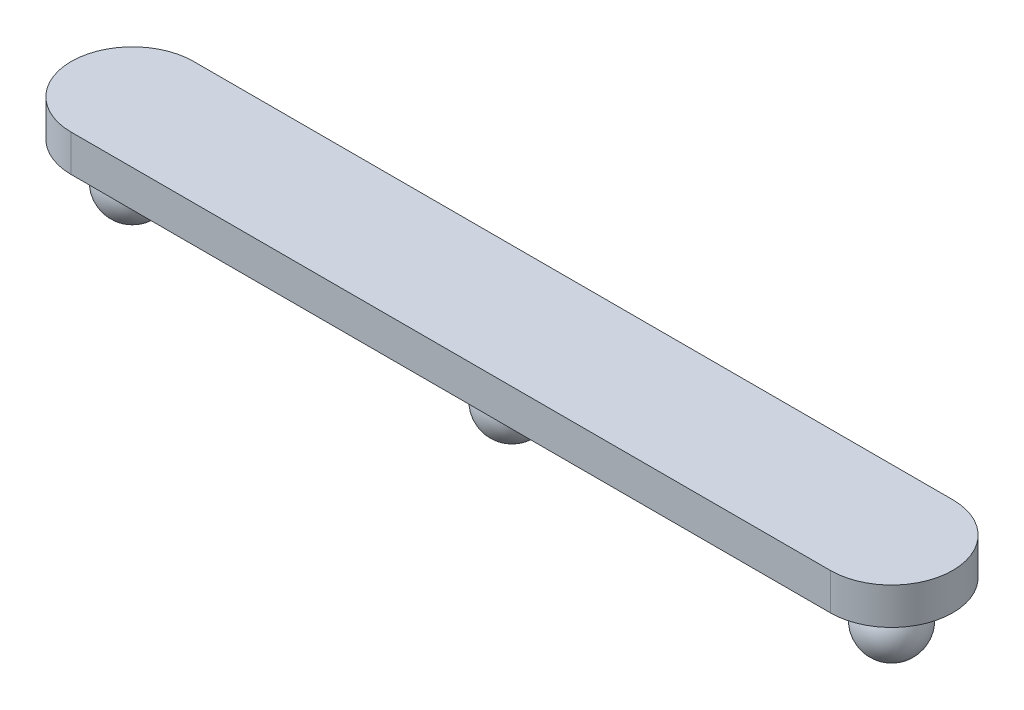
ISO-10303-21;
HEADER;
FILE_DESCRIPTION(('STEP AP214'),'2;1');
FILE_NAME('part.step','',(''),(''),'','','');
FILE_SCHEMA(('AUTOMOTIVE_DESIGN { 1 0 10303 214 1 1 1 1 }'));
ENDSEC;
DATA;
#1=APPLICATION_CONTEXT('core data for automotive mechanical design processes');
#2=APPLICATION_PROTOCOL_DEFINITION('international standard','automotive_design',2000,#1);
#3=PRODUCT_CONTEXT('',#1,'mechanical');
#4=PRODUCT('Part','Part','',(#3));
#5=PRODUCT_RELATED_PRODUCT_CATEGORY('part','',(#4));
#6=PRODUCT_DEFINITION_FORMATION('','',#4);
#7=PRODUCT_DEFINITION_CONTEXT('part definition',#1,'design');
#8=PRODUCT_DEFINITION('design','',#6,#7);
#9=PRODUCT_DEFINITION_SHAPE('','',#8);
#10=(LENGTH_UNIT() NAMED_UNIT(*) SI_UNIT(.MILLI.,.METRE.));
#11=(NAMED_UNIT(*) PLANE_ANGLE_UNIT() SI_UNIT($,.RADIAN.));
#12=(NAMED_UNIT(*) SI_UNIT($,.STERADIAN.) SOLID_ANGLE_UNIT());
#13=UNCERTAINTY_MEASURE_WITH_UNIT(LENGTH_MEASURE(1.E-05),#10,'distance_accuracy_value','');
#14=(GEOMETRIC_REPRESENTATION_CONTEXT(3) GLOBAL_UNCERTAINTY_ASSIGNED_CONTEXT((#13)) GLOBAL_UNIT_ASSIGNED_CONTEXT((#10,
#11,#12)) REPRESENTATION_CONTEXT('',''));
#15=CARTESIAN_POINT('',(0.,0.,0.));
#16=DIRECTION('',(0.,0.,1.));
#17=DIRECTION('',(1.,0.,0.));
#18=AXIS2_PLACEMENT_3D('',#15,#16,#17);
#19=CARTESIAN_POINT('',(31.,-27.,202.320508075689));
#20=DIRECTION('',(0.,1.,0.));
#21=DIRECTION('',(0.,0.,1.));
#22=AXIS2_PLACEMENT_3D('',#19,#20,#21);
#23=CYLINDRICAL_SURFACE('',#22,5.);
#24=CARTESIAN_POINT('',(31.,-24.,202.320508075689));
#25=DIRECTION('',(0.,-1.,0.));
#26=DIRECTION('',(0.,0.,-1.));
#27=AXIS2_PLACEMENT_3D('',#24,#25,#26);
#28=CIRCLE('',#27,5.);
#29=CARTESIAN_POINT('',(31.,-24.,197.320508075689));
#30=VERTEX_POINT('',#29);
#31=CARTESIAN_POINT('',(31.,-24.,207.320508075689));
#32=VERTEX_POINT('',#31);
#33=EDGE_CURVE('E107',#30,#32,#28,.T.);
#34=ORIENTED_EDGE('',*,*,#33,.T.);
#35=DIRECTION('',(0.,1.,0.));
#36=VECTOR('',#35,1.);
#37=CARTESIAN_POINT('',(31.,-27.,207.320508075689));
#38=LINE('',#37,#36);
#39=CARTESIAN_POINT('',(31.,-27.,207.320508075689));
#40=VERTEX_POINT('',#39);
#41=EDGE_CURVE('E11',#40,#32,#38,.T.);
#42=ORIENTED_EDGE('',*,*,#41,.F.);
#43=CARTESIAN_POINT('',(31.,-27.,202.320508075689));
#44=DIRECTION('',(0.,-1.,0.));
#45=DIRECTION('',(0.,0.,-1.));
#46=AXIS2_PLACEMENT_3D('',#43,#44,#45);
#47=CIRCLE('',#46,5.);
#48=CARTESIAN_POINT('',(31.,-27.,197.320508075689));
#49=VERTEX_POINT('',#48);
#50=EDGE_CURVE('E94',#49,#40,#47,.T.);
#51=ORIENTED_EDGE('',*,*,#50,.F.);
#52=DIRECTION('',(0.,1.,0.));
#53=VECTOR('',#52,1.);
#54=CARTESIAN_POINT('',(31.,-27.,197.320508075689));
#55=LINE('',#54,#53);
#56=EDGE_CURVE('E103',#49,#30,#55,.T.);
#57=ORIENTED_EDGE('',*,*,#56,.T.);
#58=EDGE_LOOP('',(#34,#42,#51,#57));
#59=FACE_BOUND('',#58,.T.);
#60=ADVANCED_FACE('F41',(#59),#23,.T.);
#61=CARTESIAN_POINT('',(31.,-27.,207.320508075689));
#62=DIRECTION('',(0.,0.,-1.));
#63=DIRECTION('',(-1.,0.,0.));
#64=AXIS2_PLACEMENT_3D('',#61,#62,#63);
#65=PLANE('',#64);
#66=DIRECTION('',(-1.,0.,0.));
#67=VECTOR('',#66,1.);
#68=CARTESIAN_POINT('',(31.,-24.,207.320508075689));
#69=LINE('',#68,#67);
#70=CARTESIAN_POINT('',(-31.,-24.,207.320508075689));
#71=VERTEX_POINT('',#70);
#72=EDGE_CURVE('E98',#32,#71,#69,.T.);
#73=ORIENTED_EDGE('',*,*,#72,.T.);
#74=DIRECTION('',(0.,1.,0.));
#75=VECTOR('',#74,1.);
#76=CARTESIAN_POINT('',(-31.,-27.,207.320508075689));
#77=LINE('',#76,#75);
#78=CARTESIAN_POINT('',(-31.,-27.,207.320508075689));
#79=VERTEX_POINT('',#78);
#80=EDGE_CURVE('E50',#79,#71,#77,.T.);
#81=ORIENTED_EDGE('',*,*,#80,.F.);
#82=DIRECTION('',(-1.,0.,0.));
#83=VECTOR('',#82,1.);
#84=CARTESIAN_POINT('',(31.,-27.,207.320508075689));
#85=LINE('',#84,#83);
#86=EDGE_CURVE('E89',#40,#79,#85,.T.);
#87=ORIENTED_EDGE('',*,*,#86,.F.);
#88=ORIENTED_EDGE('',*,*,#41,.T.);
#89=EDGE_LOOP('',(#73,#81,#87,#88));
#90=FACE_BOUND('',#89,.T.);
#91=ADVANCED_FACE('F97',(#90),#65,.F.);
#92=CARTESIAN_POINT('',(-31.,-27.,202.320508075689));
#93=DIRECTION('',(0.,1.,0.));
#94=DIRECTION('',(0.,0.,1.));
#95=AXIS2_PLACEMENT_3D('',#92,#93,#94);
#96=CYLINDRICAL_SURFACE('',#95,5.);
#97=CARTESIAN_POINT('',(-31.,-24.,202.320508075689));
#98=DIRECTION('',(0.,-1.,0.));
#99=DIRECTION('',(0.,0.,-1.));
#100=AXIS2_PLACEMENT_3D('',#97,#98,#99);
#101=CIRCLE('',#100,5.);
#102=CARTESIAN_POINT('',(-31.,-24.,197.320508075689));
#103=VERTEX_POINT('',#102);
#104=EDGE_CURVE('E76',#71,#103,#101,.T.);
#105=ORIENTED_EDGE('',*,*,#104,.T.);
#106=DIRECTION('',(0.,1.,0.));
#107=VECTOR('',#106,1.);
#108=CARTESIAN_POINT('',(-31.,-27.,197.320508075689));
#109=LINE('',#108,#107);
#110=CARTESIAN_POINT('',(-31.,-27.,197.320508075689));
#111=VERTEX_POINT('',#110);
#112=EDGE_CURVE('E99',#111,#103,#109,.T.);
#113=ORIENTED_EDGE('',*,*,#112,.F.);
#114=CARTESIAN_POINT('',(-31.,-27.,202.320508075689));
#115=DIRECTION('',(0.,-1.,0.));
#116=DIRECTION('',(0.,0.,-1.));
#117=AXIS2_PLACEMENT_3D('',#114,#115,#116);
#118=CIRCLE('',#117,5.);
#119=EDGE_CURVE('E92',#79,#111,#118,.T.);
#120=ORIENTED_EDGE('',*,*,#119,.F.);
#121=ORIENTED_EDGE('',*,*,#80,.T.);
#122=EDGE_LOOP('',(#105,#113,#120,#121));
#123=FACE_BOUND('',#122,.T.);
#124=ADVANCED_FACE('F101',(#123),#96,.T.);
#125=CARTESIAN_POINT('',(31.,-27.,197.320508075689));
#126=DIRECTION('',(0.,0.,1.));
#127=DIRECTION('',(1.,0.,0.));
#128=AXIS2_PLACEMENT_3D('',#125,#126,#127);
#129=PLANE('',#128);
#130=DIRECTION('',(1.,0.,0.));
#131=VECTOR('',#130,1.);
#132=CARTESIAN_POINT('',(31.,-24.,197.320508075689));
#133=LINE('',#132,#131);
#134=EDGE_CURVE('E82',#103,#30,#133,.T.);
#135=ORIENTED_EDGE('',*,*,#134,.T.);
#136=ORIENTED_EDGE('',*,*,#56,.F.);
#137=DIRECTION('',(1.,0.,0.));
#138=VECTOR('',#137,1.);
#139=CARTESIAN_POINT('',(31.,-27.,197.320508075689));
#140=LINE('',#139,#138);
#141=EDGE_CURVE('E59',#111,#49,#140,.T.);
#142=ORIENTED_EDGE('',*,*,#141,.F.);
#143=ORIENTED_EDGE('',*,*,#112,.T.);
#144=EDGE_LOOP('',(#135,#136,#142,#143));
#145=FACE_BOUND('',#144,.T.);
#146=ADVANCED_FACE('F158',(#145),#129,.F.);
#147=CARTESIAN_POINT('',(31.,-27.,202.320508075689));
#148=DIRECTION('',(0.,-1.,0.));
#149=DIRECTION('',(0.,0.,-1.));
#150=AXIS2_PLACEMENT_3D('',#147,#148,#149);
#151=PLANE('',#150);
#152=CARTESIAN_POINT('',(31.,-27.,202.320508075689));
#153=DIRECTION('',(0.,-1.,0.));
#154=DIRECTION('',(0.,0.,-1.));
#155=AXIS2_PLACEMENT_3D('',#152,#153,#154);
#156=CIRCLE('',#155,2.00000000000003);
#157=CARTESIAN_POINT('',(31.,-27.,200.320508075689));
#158=VERTEX_POINT('',#157);
#159=EDGE_CURVE('E118',#158,#158,#156,.T.);
#160=ORIENTED_EDGE('',*,*,#159,.F.);
#161=EDGE_LOOP('',(#160));
#162=FACE_BOUND('',#161,.T.);
#163=CARTESIAN_POINT('',(0.,-27.,202.320508075689));
#164=DIRECTION('',(0.,-1.,0.));
#165=DIRECTION('',(0.,0.,-1.));
#166=AXIS2_PLACEMENT_3D('',#163,#164,#165);
#167=CIRCLE('',#166,2.00000000000001);
#168=CARTESIAN_POINT('',(0.,-27.,200.320508075689));
#169=VERTEX_POINT('',#168);
#170=EDGE_CURVE('E241',#169,#169,#167,.T.);
#171=ORIENTED_EDGE('',*,*,#170,.F.);
#172=EDGE_LOOP('',(#171));
#173=FACE_BOUND('',#172,.T.);
#174=CARTESIAN_POINT('',(-31.,-27.,202.320508075689));
#175=DIRECTION('',(0.,-1.,0.));
#176=DIRECTION('',(0.,0.,-1.));
#177=AXIS2_PLACEMENT_3D('',#174,#175,#176);
#178=CIRCLE('',#177,2.00000000000001);
#179=CARTESIAN_POINT('',(-31.,-27.,200.320508075689));
#180=VERTEX_POINT('',#179);
#181=EDGE_CURVE('E110',#180,#180,#178,.T.);
#182=ORIENTED_EDGE('',*,*,#181,.F.);
#183=EDGE_LOOP('',(#182));
#184=FACE_BOUND('',#183,.T.);
#185=ORIENTED_EDGE('',*,*,#50,.T.);
#186=ORIENTED_EDGE('',*,*,#86,.T.);
#187=ORIENTED_EDGE('',*,*,#119,.T.);
#188=ORIENTED_EDGE('',*,*,#141,.T.);
#189=EDGE_LOOP('',(#185,#186,#187,#188));
#190=FACE_BOUND('',#189,.T.);
#191=ADVANCED_FACE('F90',(#162,#173,#184,#190),#151,.T.);
#192=CARTESIAN_POINT('',(31.,-24.,202.320508075689));
#193=DIRECTION('',(0.,-1.,0.));
#194=DIRECTION('',(0.,0.,-1.));
#195=AXIS2_PLACEMENT_3D('',#192,#193,#194);
#196=PLANE('',#195);
#197=ORIENTED_EDGE('',*,*,#33,.F.);
#198=ORIENTED_EDGE('',*,*,#134,.F.);
#199=ORIENTED_EDGE('',*,*,#104,.F.);
#200=ORIENTED_EDGE('',*,*,#72,.F.);
#201=EDGE_LOOP('',(#197,#198,#199,#200));
#202=FACE_BOUND('',#201,.T.);
#203=ADVANCED_FACE('F148',(#202),#196,.F.);
#204=CARTESIAN_POINT('',(-31.,-35.6568542494924,202.320508075689));
#205=DIRECTION('',(0.,1.,0.));
#206=DIRECTION('',(0.,0.,1.));
#207=AXIS2_PLACEMENT_3D('',#204,#205,#206);
#208=CYLINDRICAL_SURFACE('',#207,2.00000000000001);
#209=CARTESIAN_POINT('',(-31.,-28.5,202.320508075689));
#210=DIRECTION('',(0.,-0.999999999999999,0.));
#211=DIRECTION('',(0.,0.,-1.));
#212=AXIS2_PLACEMENT_3D('',#209,#210,#211);
#213=CIRCLE('',#212,2.00000000000001);
#214=CARTESIAN_POINT('',(-31.,-28.5,200.320508075689));
#215=VERTEX_POINT('',#214);
#216=EDGE_CURVE('E44',#215,#215,#213,.F.);
#217=ORIENTED_EDGE('',*,*,#216,.T.);
#218=EDGE_LOOP('',(#217));
#219=FACE_BOUND('',#218,.T.);
#220=ORIENTED_EDGE('',*,*,#181,.T.);
#221=EDGE_LOOP('',(#220));
#222=FACE_BOUND('',#221,.T.);
#223=ADVANCED_FACE('F126',(#219,#222),#208,.T.);
#224=CARTESIAN_POINT('',(0.,-35.6568542494924,202.320508075689));
#225=DIRECTION('',(0.,1.,0.));
#226=DIRECTION('',(0.,0.,1.));
#227=AXIS2_PLACEMENT_3D('',#224,#225,#226);
#228=CYLINDRICAL_SURFACE('',#227,2.00000000000001);
#229=CARTESIAN_POINT('',(0.,-28.5,202.320508075689));
#230=DIRECTION('',(0.,-1.,0.));
#231=DIRECTION('',(0.,0.,-1.));
#232=AXIS2_PLACEMENT_3D('',#229,#230,#231);
#233=CIRCLE('',#232,2.00000000000001);
#234=CARTESIAN_POINT('',(0.,-28.5,200.320508075689));
#235=VERTEX_POINT('',#234);
#236=EDGE_CURVE('E119',#235,#235,#233,.F.);
#237=ORIENTED_EDGE('',*,*,#236,.T.);
#238=EDGE_LOOP('',(#237));
#239=FACE_BOUND('',#238,.T.);
#240=ORIENTED_EDGE('',*,*,#170,.T.);
#241=EDGE_LOOP('',(#240));
#242=FACE_BOUND('',#241,.T.);
#243=ADVANCED_FACE('F156',(#239,#242),#228,.T.);
#244=CARTESIAN_POINT('',(31.,-35.6568542494924,202.320508075689));
#245=DIRECTION('',(0.,1.,0.));
#246=DIRECTION('',(0.,0.,1.));
#247=AXIS2_PLACEMENT_3D('',#244,#245,#246);
#248=CYLINDRICAL_SURFACE('',#247,2.00000000000003);
#249=CARTESIAN_POINT('',(31.,-28.5,202.320508075689));
#250=DIRECTION('',(0.,-0.999999999999999,0.));
#251=DIRECTION('',(0.,0.,-1.));
#252=AXIS2_PLACEMENT_3D('',#249,#250,#251);
#253=CIRCLE('',#252,2.00000000000003);
#254=CARTESIAN_POINT('',(31.,-28.5,200.320508075689));
#255=VERTEX_POINT('',#254);
#256=EDGE_CURVE('E116',#255,#255,#253,.F.);
#257=ORIENTED_EDGE('',*,*,#256,.T.);
#258=EDGE_LOOP('',(#257));
#259=FACE_BOUND('',#258,.T.);
#260=ORIENTED_EDGE('',*,*,#159,.T.);
#261=EDGE_LOOP('',(#260));
#262=FACE_BOUND('',#261,.T.);
#263=ADVANCED_FACE('F199',(#259,#262),#248,.T.);
#264=CARTESIAN_POINT('',(31.,-30.,202.320508075689));
#265=DIRECTION('',(-1.,0.,0.));
#266=DIRECTION('',(0.,0.,1.));
#267=AXIS2_PLACEMENT_3D('',#264,#265,#266);
#268=SPHERICAL_SURFACE('',#267,2.5);
#269=CARTESIAN_POINT('',(31.,-30.,202.320508075689));
#270=DIRECTION('',(0.,-1.,0.));
#271=DIRECTION('',(0.,0.,-1.));
#272=AXIS2_PLACEMENT_3D('',#269,#270,#271);
#273=SPHERICAL_SURFACE('',#272,2.5);
#274=ORIENTED_EDGE('',*,*,#256,.F.);
#275=EDGE_LOOP('',(#274));
#276=FACE_BOUND('',#275,.T.);
#277=ADVANCED_FACE('F137',(#276),#273,.T.);
#278=CARTESIAN_POINT('',(0.,-30.,202.320508075689));
#279=DIRECTION('',(-1.,0.,0.));
#280=DIRECTION('',(0.,0.,1.));
#281=AXIS2_PLACEMENT_3D('',#278,#279,#280);
#282=SPHERICAL_SURFACE('',#281,2.5);
#283=CARTESIAN_POINT('',(0.,-30.,202.320508075689));
#284=DIRECTION('',(0.,-1.,0.));
#285=DIRECTION('',(0.,0.,-1.));
#286=AXIS2_PLACEMENT_3D('',#283,#284,#285);
#287=SPHERICAL_SURFACE('',#286,2.5);
#288=ORIENTED_EDGE('',*,*,#236,.F.);
#289=EDGE_LOOP('',(#288));
#290=FACE_BOUND('',#289,.T.);
#291=ADVANCED_FACE('F131',(#290),#287,.T.);
#292=CARTESIAN_POINT('',(-31.,-30.,202.320508075689));
#293=DIRECTION('',(-1.,0.,0.));
#294=DIRECTION('',(0.,0.,1.));
#295=AXIS2_PLACEMENT_3D('',#292,#293,#294);
#296=SPHERICAL_SURFACE('',#295,2.5);
#297=CARTESIAN_POINT('',(-31.,-30.,202.320508075689));
#298=DIRECTION('',(0.,-1.,0.));
#299=DIRECTION('',(0.,0.,-1.));
#300=AXIS2_PLACEMENT_3D('',#297,#298,#299);
#301=SPHERICAL_SURFACE('',#300,2.5);
#302=ORIENTED_EDGE('',*,*,#216,.F.);
#303=EDGE_LOOP('',(#302));
#304=FACE_BOUND('',#303,.T.);
#305=ADVANCED_FACE('F129',(#304),#301,.T.);
#306=CLOSED_SHELL('',(#60,#91,#124,#146,#191,#203,#223,#243,#263,#277,#291,#305));
#307=MANIFOLD_SOLID_BREP('B2',#306);
#308=ADVANCED_BREP_SHAPE_REPRESENTATION('',(#18,#307),#14);
#309=SHAPE_DEFINITION_REPRESENTATION(#9,#308);
ENDSEC;
END-ISO-10303-21;
